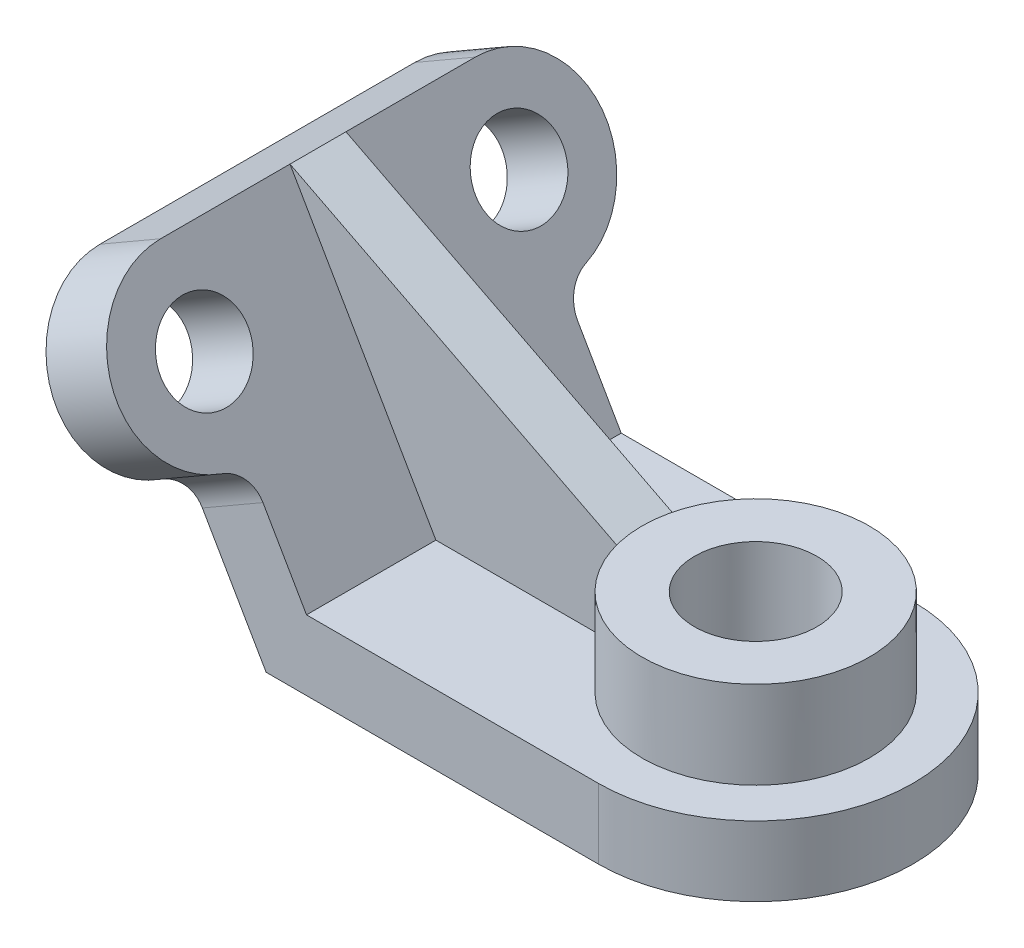
ISO-10303-21;
HEADER;
FILE_DESCRIPTION(('STEP AP214'),'2;1');
FILE_NAME('part.step','',(''),(''),'','','');
FILE_SCHEMA(('AUTOMOTIVE_DESIGN { 1 0 10303 214 1 1 1 1 }'));
ENDSEC;
DATA;
#1=APPLICATION_CONTEXT('core data for automotive mechanical design processes');
#2=APPLICATION_PROTOCOL_DEFINITION('international standard','automotive_design',2000,#1);
#3=PRODUCT_CONTEXT('',#1,'mechanical');
#4=PRODUCT('Part','Part','',(#3));
#5=PRODUCT_RELATED_PRODUCT_CATEGORY('part','',(#4));
#6=PRODUCT_DEFINITION_FORMATION('','',#4);
#7=PRODUCT_DEFINITION_CONTEXT('part definition',#1,'design');
#8=PRODUCT_DEFINITION('design','',#6,#7);
#9=PRODUCT_DEFINITION_SHAPE('','',#8);
#10=(LENGTH_UNIT() NAMED_UNIT(*) SI_UNIT(.MILLI.,.METRE.));
#11=(NAMED_UNIT(*) PLANE_ANGLE_UNIT() SI_UNIT($,.RADIAN.));
#12=(NAMED_UNIT(*) SI_UNIT($,.STERADIAN.) SOLID_ANGLE_UNIT());
#13=UNCERTAINTY_MEASURE_WITH_UNIT(LENGTH_MEASURE(1.E-05),#10,'distance_accuracy_value','');
#14=(GEOMETRIC_REPRESENTATION_CONTEXT(3) GLOBAL_UNCERTAINTY_ASSIGNED_CONTEXT((#13)) GLOBAL_UNIT_ASSIGNED_CONTEXT((#10,
#11,#12)) REPRESENTATION_CONTEXT('',''));
#15=CARTESIAN_POINT('',(0.,0.,0.));
#16=DIRECTION('',(0.,0.,1.));
#17=DIRECTION('',(1.,0.,0.));
#18=AXIS2_PLACEMENT_3D('',#15,#16,#17);
#19=CARTESIAN_POINT('',(11.5470053837926,20.,-45.));
#20=DIRECTION('',(0.86602540378444,0.499999999999998,0.));
#21=DIRECTION('',(-0.499999999999998,0.86602540378444,0.));
#22=AXIS2_PLACEMENT_3D('',#19,#20,#21);
#23=PLANE('',#22);
#24=CARTESIAN_POINT('',(-17.6794919243111,70.6217782649108,-45.));
#25=DIRECTION('',(0.86602540378444,0.499999999999998,0.));
#26=DIRECTION('',(-0.499999999999998,0.86602540378444,0.));
#27=AXIS2_PLACEMENT_3D('',#24,#25,#26);
#28=CIRCLE('',#27,12.5);
#29=CARTESIAN_POINT('',(-23.9294919243111,81.4470958122163,-45.));
#30=VERTEX_POINT('',#29);
#31=EDGE_CURVE('E187',#30,#30,#28,.T.);
#32=ORIENTED_EDGE('',*,*,#31,.F.);
#33=EDGE_LOOP('',(#32));
#34=FACE_BOUND('',#33,.T.);
#35=DIRECTION('',(0.,0.,1.));
#36=VECTOR('',#35,1.);
#37=CARTESIAN_POINT('',(-30.179491924311,92.2724133595217,-45.));
#38=LINE('',#37,#36);
#39=CARTESIAN_POINT('',(-30.179491924311,92.2724133595217,-45.));
#40=VERTEX_POINT('',#39);
#41=CARTESIAN_POINT('',(-30.179491924311,92.2724133595217,-8.00000000000001));
#42=VERTEX_POINT('',#41);
#43=EDGE_CURVE('E248',#40,#42,#38,.T.);
#44=ORIENTED_EDGE('',*,*,#43,.T.);
#45=DIRECTION('',(0.499999999999998,-0.86602540378444,0.));
#46=VECTOR('',#45,1.);
#47=CARTESIAN_POINT('',(11.5470053837926,20.,-8.));
#48=LINE('',#47,#46);
#49=CARTESIAN_POINT('',(11.5470053837926,20.,-8.00000000000001));
#50=VERTEX_POINT('',#49);
#51=EDGE_CURVE('E160',#42,#50,#48,.T.);
#52=ORIENTED_EDGE('',*,*,#51,.T.);
#53=DIRECTION('',(0.,0.,1.));
#54=VECTOR('',#53,1.);
#55=CARTESIAN_POINT('',(11.5470053837926,20.,-45.));
#56=LINE('',#55,#54);
#57=CARTESIAN_POINT('',(11.5470053837926,20.,-45.));
#58=VERTEX_POINT('',#57);
#59=EDGE_CURVE('E157',#58,#50,#56,.T.);
#60=ORIENTED_EDGE('',*,*,#59,.F.);
#61=DIRECTION('',(-0.499999999999998,0.86602540378444,0.));
#62=VECTOR('',#61,1.);
#63=CARTESIAN_POINT('',(11.5470053837926,20.,-45.));
#64=LINE('',#63,#62);
#65=CARTESIAN_POINT('',(-0.908982093062737,41.5744031683551,-45.));
#66=VERTEX_POINT('',#65);
#67=EDGE_CURVE('E222',#58,#66,#64,.T.);
#68=ORIENTED_EDGE('',*,*,#67,.T.);
#69=CARTESIAN_POINT('',(-0.90898209306273,41.5744031683551,-55.));
#70=DIRECTION('',(0.86602540378444,0.499999999999998,0.));
#71=DIRECTION('',(-0.499999999999998,0.86602540378444,0.));
#72=AXIS2_PLACEMENT_3D('',#69,#70,#71);
#73=CIRCLE('',#72,10.);
#74=CARTESIAN_POINT('',(-5.70055633056226,49.8736531959425,-52.1428571428571));
#75=VERTEX_POINT('',#74);
#76=EDGE_CURVE('E263',#66,#75,#73,.F.);
#77=ORIENTED_EDGE('',*,*,#76,.T.);
#78=CARTESIAN_POINT('',(-17.6794919243111,70.6217782649108,-45.));
#79=DIRECTION('',(0.86602540378444,0.499999999999998,0.));
#80=DIRECTION('',(-0.499999999999998,0.86602540378444,0.));
#81=AXIS2_PLACEMENT_3D('',#78,#79,#80);
#82=CIRCLE('',#81,25.);
#83=EDGE_CURVE('E193',#75,#40,#82,.T.);
#84=ORIENTED_EDGE('',*,*,#83,.T.);
#85=EDGE_LOOP('',(#44,#52,#60,#68,#77,#84));
#86=FACE_BOUND('',#85,.T.);
#87=ADVANCED_FACE('F35',(#34,#86),#23,.T.);
#88=CARTESIAN_POINT('',(-47.4999999999998,82.2724133595218,-45.));
#89=DIRECTION('',(-0.86602540378444,-0.499999999999998,0.));
#90=DIRECTION('',(0.499999999999998,-0.86602540378444,0.));
#91=AXIS2_PLACEMENT_3D('',#88,#89,#90);
#92=PLANE('',#91);
#93=CARTESIAN_POINT('',(-34.9999999999999,60.6217782649108,45.));
#94=DIRECTION('',(0.86602540378444,0.499999999999998,0.));
#95=DIRECTION('',(-0.499999999999998,0.86602540378444,0.));
#96=AXIS2_PLACEMENT_3D('',#93,#94,#95);
#97=CIRCLE('',#96,25.);
#98=CARTESIAN_POINT('',(-47.4999999999998,82.2724133595218,45.));
#99=VERTEX_POINT('',#98);
#100=CARTESIAN_POINT('',(-23.0210644062511,39.8736531959425,52.1428571428571));
#101=VERTEX_POINT('',#100);
#102=EDGE_CURVE('E206',#99,#101,#97,.T.);
#103=ORIENTED_EDGE('',*,*,#102,.F.);
#104=DIRECTION('',(0.,0.,1.));
#105=VECTOR('',#104,1.);
#106=CARTESIAN_POINT('',(-47.4999999999998,82.2724133595218,-45.));
#107=LINE('',#106,#105);
#108=CARTESIAN_POINT('',(-47.4999999999998,82.2724133595218,-45.));
#109=VERTEX_POINT('',#108);
#110=EDGE_CURVE('E245',#109,#99,#107,.T.);
#111=ORIENTED_EDGE('',*,*,#110,.F.);
#112=CARTESIAN_POINT('',(-34.9999999999999,60.6217782649108,-45.));
#113=DIRECTION('',(0.86602540378444,0.499999999999998,0.));
#114=DIRECTION('',(-0.499999999999998,0.86602540378444,0.));
#115=AXIS2_PLACEMENT_3D('',#112,#113,#114);
#116=CIRCLE('',#115,25.);
#117=CARTESIAN_POINT('',(-23.0210644062511,39.8736531959425,-52.1428571428571));
#118=VERTEX_POINT('',#117);
#119=EDGE_CURVE('E202',#118,#109,#116,.T.);
#120=ORIENTED_EDGE('',*,*,#119,.F.);
#121=CARTESIAN_POINT('',(-18.2294901687515,31.5744031683552,-55.));
#122=DIRECTION('',(-0.86602540378444,-0.499999999999998,0.));
#123=DIRECTION('',(0.499999999999998,-0.86602540378444,0.));
#124=AXIS2_PLACEMENT_3D('',#121,#122,#123);
#125=CIRCLE('',#124,10.);
#126=CARTESIAN_POINT('',(-18.2294901687515,31.5744031683552,-45.));
#127=VERTEX_POINT('',#126);
#128=EDGE_CURVE('E265',#118,#127,#125,.F.);
#129=ORIENTED_EDGE('',*,*,#128,.T.);
#130=DIRECTION('',(0.499999999999998,-0.86602540378444,0.));
#131=VECTOR('',#130,1.);
#132=CARTESIAN_POINT('',(-47.4999999999998,82.2724133595218,-45.));
#133=LINE('',#132,#131);
#134=CARTESIAN_POINT('',(0.,0.,-45.));
#135=VERTEX_POINT('',#134);
#136=EDGE_CURVE('E212',#127,#135,#133,.T.);
#137=ORIENTED_EDGE('',*,*,#136,.T.);
#138=DIRECTION('',(0.,0.,1.));
#139=VECTOR('',#138,1.);
#140=CARTESIAN_POINT('',(0.,0.,-45.));
#141=LINE('',#140,#139);
#142=CARTESIAN_POINT('',(0.,0.,45.));
#143=VERTEX_POINT('',#142);
#144=EDGE_CURVE('E228',#135,#143,#141,.T.);
#145=ORIENTED_EDGE('',*,*,#144,.T.);
#146=DIRECTION('',(0.499999999999998,-0.86602540378444,0.));
#147=VECTOR('',#146,1.);
#148=CARTESIAN_POINT('',(-47.4999999999998,82.2724133595218,45.));
#149=LINE('',#148,#147);
#150=CARTESIAN_POINT('',(-18.2294901687515,31.5744031683552,45.));
#151=VERTEX_POINT('',#150);
#152=EDGE_CURVE('E209',#151,#143,#149,.T.);
#153=ORIENTED_EDGE('',*,*,#152,.F.);
#154=CARTESIAN_POINT('',(-18.2294901687515,31.5744031683552,55.));
#155=DIRECTION('',(-0.86602540378444,-0.499999999999998,0.));
#156=DIRECTION('',(0.499999999999998,-0.86602540378444,0.));
#157=AXIS2_PLACEMENT_3D('',#154,#155,#156);
#158=CIRCLE('',#157,10.);
#159=EDGE_CURVE('E11',#151,#101,#158,.F.);
#160=ORIENTED_EDGE('',*,*,#159,.T.);
#161=EDGE_LOOP('',(#103,#111,#120,#129,#137,#145,#153,#160));
#162=FACE_BOUND('',#161,.T.);
#163=CARTESIAN_POINT('',(-34.9999999999999,60.6217782649109,45.));
#164=DIRECTION('',(0.86602540378444,0.499999999999998,0.));
#165=DIRECTION('',(-0.499999999999998,0.86602540378444,0.));
#166=AXIS2_PLACEMENT_3D('',#163,#164,#165);
#167=CIRCLE('',#166,12.5);
#168=CARTESIAN_POINT('',(-41.2499999999999,71.4470958122163,45.));
#169=VERTEX_POINT('',#168);
#170=EDGE_CURVE('E190',#169,#169,#167,.T.);
#171=ORIENTED_EDGE('',*,*,#170,.T.);
#172=EDGE_LOOP('',(#171));
#173=FACE_BOUND('',#172,.T.);
#174=CARTESIAN_POINT('',(-34.9999999999999,60.6217782649109,-45.));
#175=DIRECTION('',(0.86602540378444,0.499999999999998,0.));
#176=DIRECTION('',(-0.499999999999998,0.86602540378444,0.));
#177=AXIS2_PLACEMENT_3D('',#174,#175,#176);
#178=CIRCLE('',#177,12.5);
#179=CARTESIAN_POINT('',(-41.2499999999999,71.4470958122163,-45.));
#180=VERTEX_POINT('',#179);
#181=EDGE_CURVE('E197',#180,#180,#178,.T.);
#182=ORIENTED_EDGE('',*,*,#181,.T.);
#183=EDGE_LOOP('',(#182));
#184=FACE_BOUND('',#183,.T.);
#185=ADVANCED_FACE('F280',(#162,#173,#184),#92,.T.);
#186=CARTESIAN_POINT('',(-30.179491924311,92.2724133595217,-45.));
#187=DIRECTION('',(-0.499999999999999,0.866025403784439,0.));
#188=DIRECTION('',(-0.86602540378444,-0.499999999999999,0.));
#189=AXIS2_PLACEMENT_3D('',#186,#187,#188);
#190=PLANE('',#189);
#191=CARTESIAN_POINT('',(-30.179491924311,92.2724133595217,7.99999999999999));
#192=VERTEX_POINT('',#191);
#193=CARTESIAN_POINT('',(-30.179491924311,92.2724133595217,45.));
#194=VERTEX_POINT('',#193);
#195=EDGE_CURVE('E250',#192,#194,#38,.T.);
#196=ORIENTED_EDGE('',*,*,#195,.F.);
#197=DIRECTION('',(0.,0.,-1.));
#198=VECTOR('',#197,1.);
#199=CARTESIAN_POINT('',(-30.1794919243111,92.2724133595218,-45.));
#200=LINE('',#199,#198);
#201=EDGE_CURVE('E57',#42,#192,#200,.F.);
#202=ORIENTED_EDGE('',*,*,#201,.F.);
#203=ORIENTED_EDGE('',*,*,#43,.F.);
#204=DIRECTION('',(-0.866025403784439,-0.499999999999999,0.));
#205=VECTOR('',#204,1.);
#206=CARTESIAN_POINT('',(-30.179491924311,92.2724133595217,-45.));
#207=LINE('',#206,#205);
#208=EDGE_CURVE('E225',#40,#109,#207,.T.);
#209=ORIENTED_EDGE('',*,*,#208,.T.);
#210=ORIENTED_EDGE('',*,*,#110,.T.);
#211=DIRECTION('',(-0.866025403784439,-0.499999999999999,0.));
#212=VECTOR('',#211,1.);
#213=CARTESIAN_POINT('',(-30.179491924311,92.2724133595217,45.));
#214=LINE('',#213,#212);
#215=EDGE_CURVE('E215',#194,#99,#214,.T.);
#216=ORIENTED_EDGE('',*,*,#215,.F.);
#217=EDGE_LOOP('',(#196,#202,#203,#209,#210,#216));
#218=FACE_BOUND('',#217,.T.);
#219=ADVANCED_FACE('F286',(#218),#190,.T.);
#220=DIRECTION('',(0.499999999999998,-0.86602540378444,0.));
#221=VECTOR('',#220,1.);
#222=CARTESIAN_POINT('',(11.5470053837926,20.,8.));
#223=LINE('',#222,#221);
#224=CARTESIAN_POINT('',(11.5470053837926,20.,7.99999999999999));
#225=VERTEX_POINT('',#224);
#226=EDGE_CURVE('E50',#192,#225,#223,.T.);
#227=ORIENTED_EDGE('',*,*,#226,.F.);
#228=ORIENTED_EDGE('',*,*,#195,.T.);
#229=CARTESIAN_POINT('',(-17.6794919243111,70.6217782649108,45.));
#230=DIRECTION('',(0.86602540378444,0.499999999999998,0.));
#231=DIRECTION('',(-0.499999999999998,0.86602540378444,0.));
#232=AXIS2_PLACEMENT_3D('',#229,#230,#231);
#233=CIRCLE('',#232,25.);
#234=CARTESIAN_POINT('',(-5.70055633056226,49.8736531959425,52.1428571428571));
#235=VERTEX_POINT('',#234);
#236=EDGE_CURVE('E204',#194,#235,#233,.T.);
#237=ORIENTED_EDGE('',*,*,#236,.T.);
#238=CARTESIAN_POINT('',(-0.90898209306273,41.5744031683551,55.));
#239=DIRECTION('',(0.86602540378444,0.499999999999998,0.));
#240=DIRECTION('',(-0.499999999999998,0.86602540378444,0.));
#241=AXIS2_PLACEMENT_3D('',#238,#239,#240);
#242=CIRCLE('',#241,10.);
#243=CARTESIAN_POINT('',(-0.908982093062737,41.5744031683551,45.));
#244=VERTEX_POINT('',#243);
#245=EDGE_CURVE('E43',#235,#244,#242,.F.);
#246=ORIENTED_EDGE('',*,*,#245,.T.);
#247=DIRECTION('',(-0.499999999999998,0.86602540378444,0.));
#248=VECTOR('',#247,1.);
#249=CARTESIAN_POINT('',(11.5470053837926,20.,45.));
#250=LINE('',#249,#248);
#251=CARTESIAN_POINT('',(11.5470053837926,20.,45.));
#252=VERTEX_POINT('',#251);
#253=EDGE_CURVE('E240',#252,#244,#250,.T.);
#254=ORIENTED_EDGE('',*,*,#253,.F.);
#255=EDGE_CURVE('E252',#225,#252,#56,.T.);
#256=ORIENTED_EDGE('',*,*,#255,.F.);
#257=EDGE_LOOP('',(#227,#228,#237,#246,#254,#256));
#258=FACE_BOUND('',#257,.T.);
#259=CARTESIAN_POINT('',(-17.6794919243111,70.6217782649108,45.));
#260=DIRECTION('',(0.86602540378444,0.499999999999998,0.));
#261=DIRECTION('',(-0.499999999999998,0.86602540378444,0.));
#262=AXIS2_PLACEMENT_3D('',#259,#260,#261);
#263=CIRCLE('',#262,12.5);
#264=CARTESIAN_POINT('',(-23.9294919243111,81.4470958122163,45.));
#265=VERTEX_POINT('',#264);
#266=EDGE_CURVE('E194',#265,#265,#263,.T.);
#267=ORIENTED_EDGE('',*,*,#266,.F.);
#268=EDGE_LOOP('',(#267));
#269=FACE_BOUND('',#268,.T.);
#270=ADVANCED_FACE('F267',(#258,#269),#23,.T.);
#271=CARTESIAN_POINT('',(95.,20.,-45.));
#272=DIRECTION('',(0.,1.,0.));
#273=DIRECTION('',(-1.,0.,0.));
#274=AXIS2_PLACEMENT_3D('',#271,#272,#273);
#275=PLANE('',#274);
#276=DIRECTION('',(1.,0.,0.));
#277=VECTOR('',#276,1.);
#278=CARTESIAN_POINT('',(95.,20.,8.));
#279=LINE('',#278,#277);
#280=CARTESIAN_POINT('',(63.5,20.,8.));
#281=VERTEX_POINT('',#280);
#282=EDGE_CURVE('E167',#225,#281,#279,.T.);
#283=ORIENTED_EDGE('',*,*,#282,.F.);
#284=ORIENTED_EDGE('',*,*,#255,.T.);
#285=DIRECTION('',(-1.,0.,0.));
#286=VECTOR('',#285,1.);
#287=CARTESIAN_POINT('',(95.,20.,45.));
#288=LINE('',#287,#286);
#289=CARTESIAN_POINT('',(95.,20.,45.));
#290=VERTEX_POINT('',#289);
#291=EDGE_CURVE('E237',#290,#252,#288,.T.);
#292=ORIENTED_EDGE('',*,*,#291,.F.);
#293=CARTESIAN_POINT('',(95.,20.,0.));
#294=DIRECTION('',(0.,1.,0.));
#295=DIRECTION('',(-1.,0.,0.));
#296=AXIS2_PLACEMENT_3D('',#293,#294,#295);
#297=CIRCLE('',#296,45.);
#298=CARTESIAN_POINT('',(95.,20.,-45.));
#299=VERTEX_POINT('',#298);
#300=EDGE_CURVE('E183',#290,#299,#297,.T.);
#301=ORIENTED_EDGE('',*,*,#300,.T.);
#302=DIRECTION('',(-1.,0.,0.));
#303=VECTOR('',#302,1.);
#304=CARTESIAN_POINT('',(95.,20.,-45.));
#305=LINE('',#304,#303);
#306=EDGE_CURVE('E220',#299,#58,#305,.T.);
#307=ORIENTED_EDGE('',*,*,#306,.T.);
#308=ORIENTED_EDGE('',*,*,#59,.T.);
#309=DIRECTION('',(1.,0.,0.));
#310=VECTOR('',#309,1.);
#311=CARTESIAN_POINT('',(95.,20.,-8.));
#312=LINE('',#311,#310);
#313=CARTESIAN_POINT('',(63.5,20.,-8.));
#314=VERTEX_POINT('',#313);
#315=EDGE_CURVE('E154',#50,#314,#312,.T.);
#316=ORIENTED_EDGE('',*,*,#315,.T.);
#317=CARTESIAN_POINT('',(95.,20.,0.));
#318=DIRECTION('',(0.,1.,0.));
#319=DIRECTION('',(-1.,0.,0.));
#320=AXIS2_PLACEMENT_3D('',#317,#318,#319);
#321=CIRCLE('',#320,32.5);
#322=EDGE_CURVE('E139',#281,#314,#321,.T.);
#323=ORIENTED_EDGE('',*,*,#322,.F.);
#324=EDGE_LOOP('',(#283,#284,#292,#301,#307,#308,#316,#323));
#325=FACE_BOUND('',#324,.T.);
#326=ADVANCED_FACE('F155',(#325),#275,.T.);
#327=CARTESIAN_POINT('',(0.,0.,-45.));
#328=DIRECTION('',(0.,-1.,0.));
#329=DIRECTION('',(0.,0.,-1.));
#330=AXIS2_PLACEMENT_3D('',#327,#328,#329);
#331=PLANE('',#330);
#332=CARTESIAN_POINT('',(95.,0.,0.));
#333=DIRECTION('',(0.,-1.,0.));
#334=DIRECTION('',(0.,0.,-1.));
#335=AXIS2_PLACEMENT_3D('',#332,#333,#334);
#336=CIRCLE('',#335,17.5);
#337=CARTESIAN_POINT('',(95.,0.,-17.5));
#338=VERTEX_POINT('',#337);
#339=EDGE_CURVE('E177',#338,#338,#336,.T.);
#340=ORIENTED_EDGE('',*,*,#339,.F.);
#341=EDGE_LOOP('',(#340));
#342=FACE_BOUND('',#341,.T.);
#343=DIRECTION('',(1.,0.,0.));
#344=VECTOR('',#343,1.);
#345=CARTESIAN_POINT('',(0.,0.,-45.));
#346=LINE('',#345,#344);
#347=CARTESIAN_POINT('',(95.,0.,-45.));
#348=VERTEX_POINT('',#347);
#349=EDGE_CURVE('E214',#135,#348,#346,.T.);
#350=ORIENTED_EDGE('',*,*,#349,.T.);
#351=CARTESIAN_POINT('',(95.,0.,0.));
#352=DIRECTION('',(0.,1.,0.));
#353=DIRECTION('',(-1.,0.,0.));
#354=AXIS2_PLACEMENT_3D('',#351,#352,#353);
#355=CIRCLE('',#354,45.);
#356=CARTESIAN_POINT('',(95.,0.,45.));
#357=VERTEX_POINT('',#356);
#358=EDGE_CURVE('E185',#357,#348,#355,.T.);
#359=ORIENTED_EDGE('',*,*,#358,.F.);
#360=DIRECTION('',(1.,0.,0.));
#361=VECTOR('',#360,1.);
#362=CARTESIAN_POINT('',(0.,0.,45.));
#363=LINE('',#362,#361);
#364=EDGE_CURVE('E231',#143,#357,#363,.T.);
#365=ORIENTED_EDGE('',*,*,#364,.F.);
#366=ORIENTED_EDGE('',*,*,#144,.F.);
#367=EDGE_LOOP('',(#350,#359,#365,#366));
#368=FACE_BOUND('',#367,.T.);
#369=ADVANCED_FACE('F319',(#342,#368),#331,.T.);
#370=CARTESIAN_POINT('',(0.,0.,-45.));
#371=DIRECTION('',(0.,0.,-1.));
#372=DIRECTION('',(-1.,0.,0.));
#373=AXIS2_PLACEMENT_3D('',#370,#371,#372);
#374=PLANE('',#373);
#375=ORIENTED_EDGE('',*,*,#136,.F.);
#376=DIRECTION('',(-0.86602540378444,-0.499999999999998,0.));
#377=VECTOR('',#376,1.);
#378=CARTESIAN_POINT('',(-0.908982093062713,41.5744031683551,-45.));
#379=LINE('',#378,#377);
#380=EDGE_CURVE('E247',#127,#66,#379,.F.);
#381=ORIENTED_EDGE('',*,*,#380,.T.);
#382=ORIENTED_EDGE('',*,*,#67,.F.);
#383=ORIENTED_EDGE('',*,*,#306,.F.);
#384=DIRECTION('',(0.,1.,0.));
#385=VECTOR('',#384,1.);
#386=CARTESIAN_POINT('',(95.,0.,-45.));
#387=LINE('',#386,#385);
#388=EDGE_CURVE('E218',#348,#299,#387,.T.);
#389=ORIENTED_EDGE('',*,*,#388,.F.);
#390=ORIENTED_EDGE('',*,*,#349,.F.);
#391=EDGE_LOOP('',(#375,#381,#382,#383,#389,#390));
#392=FACE_BOUND('',#391,.T.);
#393=ADVANCED_FACE('F298',(#392),#374,.T.);
#394=CARTESIAN_POINT('',(0.,0.,45.));
#395=DIRECTION('',(0.,0.,-1.));
#396=DIRECTION('',(-1.,0.,0.));
#397=AXIS2_PLACEMENT_3D('',#394,#395,#396);
#398=PLANE('',#397);
#399=ORIENTED_EDGE('',*,*,#253,.T.);
#400=DIRECTION('',(0.86602540378444,0.499999999999998,0.));
#401=VECTOR('',#400,1.);
#402=CARTESIAN_POINT('',(-18.2294901687515,31.5744031683552,45.));
#403=LINE('',#402,#401);
#404=EDGE_CURVE('E261',#244,#151,#403,.F.);
#405=ORIENTED_EDGE('',*,*,#404,.T.);
#406=ORIENTED_EDGE('',*,*,#152,.T.);
#407=ORIENTED_EDGE('',*,*,#364,.T.);
#408=DIRECTION('',(0.,1.,0.));
#409=VECTOR('',#408,1.);
#410=CARTESIAN_POINT('',(95.,0.,45.));
#411=LINE('',#410,#409);
#412=EDGE_CURVE('E234',#357,#290,#411,.T.);
#413=ORIENTED_EDGE('',*,*,#412,.T.);
#414=ORIENTED_EDGE('',*,*,#291,.T.);
#415=EDGE_LOOP('',(#399,#405,#406,#407,#413,#414));
#416=FACE_BOUND('',#415,.T.);
#417=ADVANCED_FACE('F274',(#416),#398,.F.);
#418=CARTESIAN_POINT('',(-34.9999999999999,60.6217782649108,45.));
#419=DIRECTION('',(0.86602540378444,0.499999999999998,0.));
#420=DIRECTION('',(-0.499999999999998,0.86602540378444,0.));
#421=AXIS2_PLACEMENT_3D('',#418,#419,#420);
#422=CYLINDRICAL_SURFACE('',#421,25.);
#423=ORIENTED_EDGE('',*,*,#102,.T.);
#424=DIRECTION('',(0.86602540378444,0.499999999999998,0.));
#425=VECTOR('',#424,1.);
#426=CARTESIAN_POINT('',(-23.0210644062511,39.8736531959425,52.1428571428571));
#427=LINE('',#426,#425);
#428=EDGE_CURVE('E258',#101,#235,#427,.T.);
#429=ORIENTED_EDGE('',*,*,#428,.T.);
#430=ORIENTED_EDGE('',*,*,#236,.F.);
#431=ORIENTED_EDGE('',*,*,#215,.T.);
#432=EDGE_LOOP('',(#423,#429,#430,#431));
#433=FACE_BOUND('',#432,.T.);
#434=ADVANCED_FACE('F284',(#433),#422,.T.);
#435=CARTESIAN_POINT('',(-34.9999999999999,60.6217782649108,-45.));
#436=DIRECTION('',(0.86602540378444,0.499999999999998,0.));
#437=DIRECTION('',(-0.499999999999998,0.86602540378444,0.));
#438=AXIS2_PLACEMENT_3D('',#435,#436,#437);
#439=CYLINDRICAL_SURFACE('',#438,25.);
#440=ORIENTED_EDGE('',*,*,#83,.F.);
#441=DIRECTION('',(0.86602540378444,0.499999999999998,0.));
#442=VECTOR('',#441,1.);
#443=CARTESIAN_POINT('',(-23.0210644062511,39.8736531959425,-52.1428571428571));
#444=LINE('',#443,#442);
#445=EDGE_CURVE('E256',#75,#118,#444,.F.);
#446=ORIENTED_EDGE('',*,*,#445,.T.);
#447=ORIENTED_EDGE('',*,*,#119,.T.);
#448=ORIENTED_EDGE('',*,*,#208,.F.);
#449=EDGE_LOOP('',(#440,#446,#447,#448));
#450=FACE_BOUND('',#449,.T.);
#451=ADVANCED_FACE('F351',(#450),#439,.T.);
#452=CARTESIAN_POINT('',(-34.9999999999999,60.6217782649109,-45.));
#453=DIRECTION('',(0.86602540378444,0.499999999999998,0.));
#454=DIRECTION('',(-0.499999999999998,0.86602540378444,0.));
#455=AXIS2_PLACEMENT_3D('',#452,#453,#454);
#456=CYLINDRICAL_SURFACE('',#455,12.5);
#457=ORIENTED_EDGE('',*,*,#181,.F.);
#458=EDGE_LOOP('',(#457));
#459=FACE_BOUND('',#458,.T.);
#460=ORIENTED_EDGE('',*,*,#31,.T.);
#461=EDGE_LOOP('',(#460));
#462=FACE_BOUND('',#461,.T.);
#463=ADVANCED_FACE('F354',(#459,#462),#456,.F.);
#464=CARTESIAN_POINT('',(-34.9999999999999,60.6217782649109,45.));
#465=DIRECTION('',(0.86602540378444,0.499999999999998,0.));
#466=DIRECTION('',(-0.499999999999998,0.86602540378444,0.));
#467=AXIS2_PLACEMENT_3D('',#464,#465,#466);
#468=CYLINDRICAL_SURFACE('',#467,12.5);
#469=ORIENTED_EDGE('',*,*,#170,.F.);
#470=EDGE_LOOP('',(#469));
#471=FACE_BOUND('',#470,.T.);
#472=ORIENTED_EDGE('',*,*,#266,.T.);
#473=EDGE_LOOP('',(#472));
#474=FACE_BOUND('',#473,.T.);
#475=ADVANCED_FACE('F357',(#471,#474),#468,.F.);
#476=CARTESIAN_POINT('',(95.,0.,0.));
#477=DIRECTION('',(0.,1.,0.));
#478=DIRECTION('',(-1.,0.,0.));
#479=AXIS2_PLACEMENT_3D('',#476,#477,#478);
#480=CYLINDRICAL_SURFACE('',#479,45.);
#481=ORIENTED_EDGE('',*,*,#358,.T.);
#482=ORIENTED_EDGE('',*,*,#388,.T.);
#483=ORIENTED_EDGE('',*,*,#300,.F.);
#484=ORIENTED_EDGE('',*,*,#412,.F.);
#485=EDGE_LOOP('',(#481,#482,#483,#484));
#486=FACE_BOUND('',#485,.T.);
#487=ADVANCED_FACE('F316',(#486),#480,.T.);
#488=CARTESIAN_POINT('',(95.,45.,0.));
#489=DIRECTION('',(0.,1.,0.));
#490=DIRECTION('',(-1.,0.,0.));
#491=AXIS2_PLACEMENT_3D('',#488,#489,#490);
#492=PLANE('',#491);
#493=CARTESIAN_POINT('',(95.,45.,0.));
#494=DIRECTION('',(0.,1.,0.));
#495=DIRECTION('',(-1.,0.,0.));
#496=AXIS2_PLACEMENT_3D('',#493,#494,#495);
#497=CIRCLE('',#496,32.5);
#498=CARTESIAN_POINT('',(62.5,45.,0.));
#499=VERTEX_POINT('',#498);
#500=EDGE_CURVE('E149',#499,#499,#497,.T.);
#501=ORIENTED_EDGE('',*,*,#500,.T.);
#502=EDGE_LOOP('',(#501));
#503=FACE_BOUND('',#502,.T.);
#504=CARTESIAN_POINT('',(95.,45.,0.));
#505=DIRECTION('',(0.,1.,0.));
#506=DIRECTION('',(-1.,0.,0.));
#507=AXIS2_PLACEMENT_3D('',#504,#505,#506);
#508=CIRCLE('',#507,17.5);
#509=CARTESIAN_POINT('',(77.5,45.,0.));
#510=VERTEX_POINT('',#509);
#511=EDGE_CURVE('E150',#510,#510,#508,.T.);
#512=ORIENTED_EDGE('',*,*,#511,.F.);
#513=EDGE_LOOP('',(#512));
#514=FACE_BOUND('',#513,.T.);
#515=ADVANCED_FACE('F364',(#503,#514),#492,.T.);
#516=CARTESIAN_POINT('',(95.,45.,0.));
#517=DIRECTION('',(0.,-1.,0.));
#518=DIRECTION('',(1.,0.,0.));
#519=AXIS2_PLACEMENT_3D('',#516,#517,#518);
#520=CYLINDRICAL_SURFACE('',#519,32.5);
#521=CARTESIAN_POINT('',(95.,28.4229406928648,0.));
#522=DIRECTION('',(-0.454370876145576,-0.890812610435383,0.));
#523=DIRECTION('',(0.890812610435383,-0.454370876145576,0.));
#524=AXIS2_PLACEMENT_3D('',#521,#522,#523);
#525=ELLIPSE('',#524,36.4835428004501,32.5);
#526=CARTESIAN_POINT('',(63.4999999999999,44.4899366367036,8.));
#527=VERTEX_POINT('',#526);
#528=EDGE_CURVE('E173',#499,#527,#525,.F.);
#529=ORIENTED_EDGE('',*,*,#528,.T.);
#530=DIRECTION('',(0.,-1.,0.));
#531=VECTOR('',#530,1.);
#532=CARTESIAN_POINT('',(63.5,45.,8.));
#533=LINE('',#532,#531);
#534=EDGE_CURVE('E146',#527,#281,#533,.T.);
#535=ORIENTED_EDGE('',*,*,#534,.T.);
#536=ORIENTED_EDGE('',*,*,#322,.T.);
#537=DIRECTION('',(0.,-1.,0.));
#538=VECTOR('',#537,1.);
#539=CARTESIAN_POINT('',(63.5,45.,-8.));
#540=LINE('',#539,#538);
#541=CARTESIAN_POINT('',(63.5,44.4899366367035,-8.));
#542=VERTEX_POINT('',#541);
#543=EDGE_CURVE('E143',#542,#314,#540,.T.);
#544=ORIENTED_EDGE('',*,*,#543,.F.);
#545=EDGE_CURVE('E175',#542,#499,#525,.F.);
#546=ORIENTED_EDGE('',*,*,#545,.T.);
#547=ORIENTED_EDGE('',*,*,#500,.F.);
#548=EDGE_LOOP('',(#529,#535,#536,#544,#546,#547));
#549=FACE_BOUND('',#548,.T.);
#550=ADVANCED_FACE('F141',(#549),#520,.T.);
#551=CARTESIAN_POINT('',(95.,45.,0.));
#552=DIRECTION('',(0.,-1.,0.));
#553=DIRECTION('',(1.,0.,0.));
#554=AXIS2_PLACEMENT_3D('',#551,#552,#553);
#555=CYLINDRICAL_SURFACE('',#554,17.5);
#556=ORIENTED_EDGE('',*,*,#339,.T.);
#557=EDGE_LOOP('',(#556));
#558=FACE_BOUND('',#557,.T.);
#559=ORIENTED_EDGE('',*,*,#511,.T.);
#560=EDGE_LOOP('',(#559));
#561=FACE_BOUND('',#560,.T.);
#562=ADVANCED_FACE('F367',(#558,#561),#555,.F.);
#563=CARTESIAN_POINT('',(-18.2294901687515,31.5744031683552,-55.));
#564=DIRECTION('',(0.86602540378444,0.499999999999998,0.));
#565=DIRECTION('',(-0.499999999999998,0.86602540378444,0.));
#566=AXIS2_PLACEMENT_3D('',#563,#564,#565);
#567=CYLINDRICAL_SURFACE('',#566,10.);
#568=ORIENTED_EDGE('',*,*,#128,.F.);
#569=ORIENTED_EDGE('',*,*,#445,.F.);
#570=ORIENTED_EDGE('',*,*,#76,.F.);
#571=ORIENTED_EDGE('',*,*,#380,.F.);
#572=EDGE_LOOP('',(#568,#569,#570,#571));
#573=FACE_BOUND('',#572,.T.);
#574=ADVANCED_FACE('F295',(#573),#567,.F.);
#575=CARTESIAN_POINT('',(-18.2294901687515,31.5744031683552,55.));
#576=DIRECTION('',(0.86602540378444,0.499999999999998,0.));
#577=DIRECTION('',(-0.499999999999998,0.86602540378444,0.));
#578=AXIS2_PLACEMENT_3D('',#575,#576,#577);
#579=CYLINDRICAL_SURFACE('',#578,10.);
#580=ORIENTED_EDGE('',*,*,#159,.F.);
#581=ORIENTED_EDGE('',*,*,#404,.F.);
#582=ORIENTED_EDGE('',*,*,#245,.F.);
#583=ORIENTED_EDGE('',*,*,#428,.F.);
#584=EDGE_LOOP('',(#580,#581,#582,#583));
#585=FACE_BOUND('',#584,.T.);
#586=ADVANCED_FACE('F37',(#585),#579,.F.);
#587=CARTESIAN_POINT('',(-30.179491924311,92.2724133595217,0.));
#588=DIRECTION('',(-0.454370876145576,-0.890812610435383,0.));
#589=DIRECTION('',(0.890812610435383,-0.454370876145576,0.));
#590=AXIS2_PLACEMENT_3D('',#587,#588,#589);
#591=PLANE('',#590);
#592=DIRECTION('',(0.890812610435383,-0.454370876145576,0.));
#593=VECTOR('',#592,1.);
#594=CARTESIAN_POINT('',(-30.179491924311,92.2724133595217,-8.));
#595=LINE('',#594,#593);
#596=EDGE_CURVE('E165',#42,#542,#595,.T.);
#597=ORIENTED_EDGE('',*,*,#596,.F.);
#598=ORIENTED_EDGE('',*,*,#201,.T.);
#599=DIRECTION('',(0.890812610435383,-0.454370876145576,0.));
#600=VECTOR('',#599,1.);
#601=CARTESIAN_POINT('',(-30.179491924311,92.2724133595217,8.));
#602=LINE('',#601,#600);
#603=EDGE_CURVE('E303',#192,#527,#602,.T.);
#604=ORIENTED_EDGE('',*,*,#603,.T.);
#605=ORIENTED_EDGE('',*,*,#528,.F.);
#606=ORIENTED_EDGE('',*,*,#545,.F.);
#607=EDGE_LOOP('',(#597,#598,#604,#605,#606));
#608=FACE_BOUND('',#607,.T.);
#609=ADVANCED_FACE('F310',(#608),#591,.F.);
#610=CARTESIAN_POINT('',(46.2500000000001,46.1362066797609,8.));
#611=DIRECTION('',(0.,0.,1.));
#612=DIRECTION('',(1.,0.,0.));
#613=AXIS2_PLACEMENT_3D('',#610,#611,#612);
#614=PLANE('',#613);
#615=ORIENTED_EDGE('',*,*,#534,.F.);
#616=ORIENTED_EDGE('',*,*,#603,.F.);
#617=ORIENTED_EDGE('',*,*,#226,.T.);
#618=ORIENTED_EDGE('',*,*,#282,.T.);
#619=EDGE_LOOP('',(#615,#616,#617,#618));
#620=FACE_BOUND('',#619,.T.);
#621=ADVANCED_FACE('F312',(#620),#614,.T.);
#622=CARTESIAN_POINT('',(46.2500000000001,46.1362066797609,-8.));
#623=DIRECTION('',(0.,0.,1.));
#624=DIRECTION('',(1.,0.,0.));
#625=AXIS2_PLACEMENT_3D('',#622,#623,#624);
#626=PLANE('',#625);
#627=ORIENTED_EDGE('',*,*,#596,.T.);
#628=ORIENTED_EDGE('',*,*,#543,.T.);
#629=ORIENTED_EDGE('',*,*,#315,.F.);
#630=ORIENTED_EDGE('',*,*,#51,.F.);
#631=EDGE_LOOP('',(#627,#628,#629,#630));
#632=FACE_BOUND('',#631,.T.);
#633=ADVANCED_FACE('F163',(#632),#626,.F.);
#634=CLOSED_SHELL('',(#87,#185,#219,#270,#326,#369,#393,#417,#434,#451,#463,#475,#487,#515,#550,
#562,#574,#586,#609,#621,#633));
#635=MANIFOLD_SOLID_BREP('B2',#634);
#636=ADVANCED_BREP_SHAPE_REPRESENTATION('',(#18,#635),#14);
#637=SHAPE_DEFINITION_REPRESENTATION(#9,#636);
ENDSEC;
END-ISO-10303-21;
